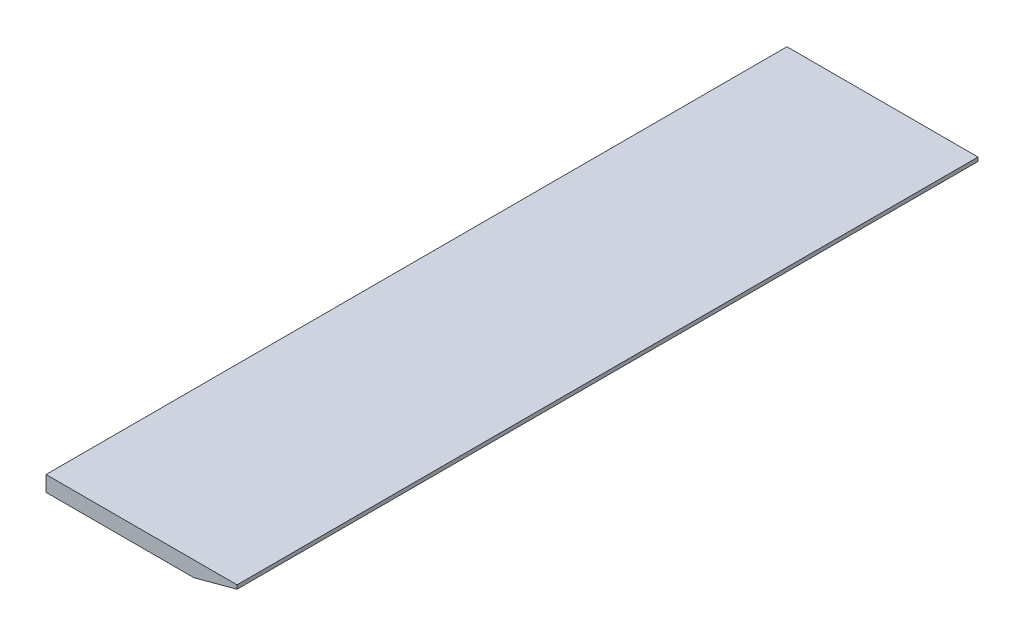
ISO-10303-21;
HEADER;
FILE_DESCRIPTION(('STEP AP214'),'2;1');
FILE_NAME('part.step','',(''),(''),'','','');
FILE_SCHEMA(('AUTOMOTIVE_DESIGN { 1 0 10303 214 1 1 1 1 }'));
ENDSEC;
DATA;
#1=APPLICATION_CONTEXT('core data for automotive mechanical design processes');
#2=APPLICATION_PROTOCOL_DEFINITION('international standard','automotive_design',2000,#1);
#3=PRODUCT_CONTEXT('',#1,'mechanical');
#4=PRODUCT('Part','Part','',(#3));
#5=PRODUCT_RELATED_PRODUCT_CATEGORY('part','',(#4));
#6=PRODUCT_DEFINITION_FORMATION('','',#4);
#7=PRODUCT_DEFINITION_CONTEXT('part definition',#1,'design');
#8=PRODUCT_DEFINITION('design','',#6,#7);
#9=PRODUCT_DEFINITION_SHAPE('','',#8);
#10=(LENGTH_UNIT() NAMED_UNIT(*) SI_UNIT(.MILLI.,.METRE.));
#11=(NAMED_UNIT(*) PLANE_ANGLE_UNIT() SI_UNIT($,.RADIAN.));
#12=(NAMED_UNIT(*) SI_UNIT($,.STERADIAN.) SOLID_ANGLE_UNIT());
#13=UNCERTAINTY_MEASURE_WITH_UNIT(LENGTH_MEASURE(1.E-05),#10,'distance_accuracy_value','');
#14=(GEOMETRIC_REPRESENTATION_CONTEXT(3) GLOBAL_UNCERTAINTY_ASSIGNED_CONTEXT((#13)) GLOBAL_UNIT_ASSIGNED_CONTEXT((#10,
#11,#12)) REPRESENTATION_CONTEXT('',''));
#15=CARTESIAN_POINT('',(0.,0.,0.));
#16=DIRECTION('',(0.,0.,1.));
#17=DIRECTION('',(1.,0.,0.));
#18=AXIS2_PLACEMENT_3D('',#15,#16,#17);
#19=CARTESIAN_POINT('',(121.627416057906,0.,304.8));
#20=DIRECTION('',(0.,1.,0.));
#21=DIRECTION('',(0.,0.,1.));
#22=AXIS2_PLACEMENT_3D('',#19,#20,#21);
#23=PLANE('',#22);
#24=DIRECTION('',(1.,0.,0.));
#25=VECTOR('',#24,1.);
#26=CARTESIAN_POINT('',(121.627416057906,0.,-304.8));
#27=LINE('',#26,#25);
#28=CARTESIAN_POINT('',(0.,0.,-304.8));
#29=VERTEX_POINT('',#28);
#30=CARTESIAN_POINT('',(121.627416057906,0.,-304.8));
#31=VERTEX_POINT('',#30);
#32=EDGE_CURVE('E106',#29,#31,#27,.T.);
#33=ORIENTED_EDGE('',*,*,#32,.T.);
#34=DIRECTION('',(0.,0.,-1.));
#35=VECTOR('',#34,1.);
#36=CARTESIAN_POINT('',(121.627416057906,0.,304.8));
#37=LINE('',#36,#35);
#38=CARTESIAN_POINT('',(121.627416057906,0.,304.8));
#39=VERTEX_POINT('',#38);
#40=EDGE_CURVE('E11',#39,#31,#37,.T.);
#41=ORIENTED_EDGE('',*,*,#40,.F.);
#42=DIRECTION('',(1.,0.,0.));
#43=VECTOR('',#42,1.);
#44=CARTESIAN_POINT('',(121.627416057906,0.,304.8));
#45=LINE('',#44,#43);
#46=CARTESIAN_POINT('',(0.,0.,304.8));
#47=VERTEX_POINT('',#46);
#48=EDGE_CURVE('E114',#47,#39,#45,.T.);
#49=ORIENTED_EDGE('',*,*,#48,.F.);
#50=DIRECTION('',(0.,0.,-1.));
#51=VECTOR('',#50,1.);
#52=CARTESIAN_POINT('',(0.,0.,304.8));
#53=LINE('',#52,#51);
#54=EDGE_CURVE('E102',#47,#29,#53,.T.);
#55=ORIENTED_EDGE('',*,*,#54,.T.);
#56=EDGE_LOOP('',(#33,#41,#49,#55));
#57=FACE_BOUND('',#56,.T.);
#58=ADVANCED_FACE('F32',(#57),#23,.F.);
#59=CARTESIAN_POINT('',(157.1752,9.52499999999998,304.8));
#60=DIRECTION('',(-0.258819045102515,0.96592582628907,0.));
#61=DIRECTION('',(-0.96592582628907,-0.258819045102515,0.));
#62=AXIS2_PLACEMENT_3D('',#59,#60,#61);
#63=PLANE('',#62);
#64=DIRECTION('',(0.96592582628907,0.258819045102515,0.));
#65=VECTOR('',#64,1.);
#66=CARTESIAN_POINT('',(157.1752,9.52499999999998,-304.8));
#67=LINE('',#66,#65);
#68=CARTESIAN_POINT('',(157.1752,9.52499999999998,-304.8));
#69=VERTEX_POINT('',#68);
#70=EDGE_CURVE('E109',#31,#69,#67,.T.);
#71=ORIENTED_EDGE('',*,*,#70,.T.);
#72=DIRECTION('',(0.,0.,-1.));
#73=VECTOR('',#72,1.);
#74=CARTESIAN_POINT('',(157.1752,9.52499999999998,304.8));
#75=LINE('',#74,#73);
#76=CARTESIAN_POINT('',(157.1752,9.52499999999998,304.8));
#77=VERTEX_POINT('',#76);
#78=EDGE_CURVE('E40',#77,#69,#75,.T.);
#79=ORIENTED_EDGE('',*,*,#78,.F.);
#80=DIRECTION('',(0.96592582628907,0.258819045102515,0.));
#81=VECTOR('',#80,1.);
#82=CARTESIAN_POINT('',(157.1752,9.52499999999998,304.8));
#83=LINE('',#82,#81);
#84=EDGE_CURVE('E82',#39,#77,#83,.T.);
#85=ORIENTED_EDGE('',*,*,#84,.F.);
#86=ORIENTED_EDGE('',*,*,#40,.T.);
#87=EDGE_LOOP('',(#71,#79,#85,#86));
#88=FACE_BOUND('',#87,.T.);
#89=ADVANCED_FACE('F133',(#88),#63,.F.);
#90=CARTESIAN_POINT('',(157.1752,12.7,304.8));
#91=DIRECTION('',(-1.,0.,0.));
#92=DIRECTION('',(0.,0.,1.));
#93=AXIS2_PLACEMENT_3D('',#90,#91,#92);
#94=PLANE('',#93);
#95=DIRECTION('',(0.,1.,0.));
#96=VECTOR('',#95,1.);
#97=CARTESIAN_POINT('',(157.1752,12.7,-304.8));
#98=LINE('',#97,#96);
#99=CARTESIAN_POINT('',(157.1752,12.7,-304.8));
#100=VERTEX_POINT('',#99);
#101=EDGE_CURVE('E97',#69,#100,#98,.T.);
#102=ORIENTED_EDGE('',*,*,#101,.T.);
#103=DIRECTION('',(0.,0.,-1.));
#104=VECTOR('',#103,1.);
#105=CARTESIAN_POINT('',(157.1752,12.7,304.8));
#106=LINE('',#105,#104);
#107=CARTESIAN_POINT('',(157.1752,12.7,304.8));
#108=VERTEX_POINT('',#107);
#109=EDGE_CURVE('E94',#108,#100,#106,.T.);
#110=ORIENTED_EDGE('',*,*,#109,.F.);
#111=DIRECTION('',(0.,1.,0.));
#112=VECTOR('',#111,1.);
#113=CARTESIAN_POINT('',(157.1752,12.7,304.8));
#114=LINE('',#113,#112);
#115=EDGE_CURVE('E86',#77,#108,#114,.T.);
#116=ORIENTED_EDGE('',*,*,#115,.F.);
#117=ORIENTED_EDGE('',*,*,#78,.T.);
#118=EDGE_LOOP('',(#102,#110,#116,#117));
#119=FACE_BOUND('',#118,.T.);
#120=ADVANCED_FACE('F95',(#119),#94,.F.);
#121=CARTESIAN_POINT('',(0.,12.7,304.8));
#122=DIRECTION('',(0.,-1.,0.));
#123=DIRECTION('',(0.,0.,-1.));
#124=AXIS2_PLACEMENT_3D('',#121,#122,#123);
#125=PLANE('',#124);
#126=DIRECTION('',(-1.,0.,0.));
#127=VECTOR('',#126,1.);
#128=CARTESIAN_POINT('',(0.,12.7,-304.8));
#129=LINE('',#128,#127);
#130=CARTESIAN_POINT('',(0.,12.7,-304.8));
#131=VERTEX_POINT('',#130);
#132=EDGE_CURVE('E68',#100,#131,#129,.T.);
#133=ORIENTED_EDGE('',*,*,#132,.T.);
#134=DIRECTION('',(0.,0.,-1.));
#135=VECTOR('',#134,1.);
#136=CARTESIAN_POINT('',(0.,12.7,304.8));
#137=LINE('',#136,#135);
#138=CARTESIAN_POINT('',(0.,12.7,304.8));
#139=VERTEX_POINT('',#138);
#140=EDGE_CURVE('E98',#139,#131,#137,.T.);
#141=ORIENTED_EDGE('',*,*,#140,.F.);
#142=DIRECTION('',(-1.,0.,0.));
#143=VECTOR('',#142,1.);
#144=CARTESIAN_POINT('',(0.,12.7,304.8));
#145=LINE('',#144,#143);
#146=EDGE_CURVE('E90',#108,#139,#145,.T.);
#147=ORIENTED_EDGE('',*,*,#146,.F.);
#148=ORIENTED_EDGE('',*,*,#109,.T.);
#149=EDGE_LOOP('',(#133,#141,#147,#148));
#150=FACE_BOUND('',#149,.T.);
#151=ADVANCED_FACE('F100',(#150),#125,.F.);
#152=CARTESIAN_POINT('',(0.,0.,304.8));
#153=DIRECTION('',(1.,0.,0.));
#154=DIRECTION('',(0.,0.,-1.));
#155=AXIS2_PLACEMENT_3D('',#152,#153,#154);
#156=PLANE('',#155);
#157=DIRECTION('',(0.,-1.,0.));
#158=VECTOR('',#157,1.);
#159=CARTESIAN_POINT('',(0.,0.,-304.8));
#160=LINE('',#159,#158);
#161=EDGE_CURVE('E74',#131,#29,#160,.T.);
#162=ORIENTED_EDGE('',*,*,#161,.T.);
#163=ORIENTED_EDGE('',*,*,#54,.F.);
#164=DIRECTION('',(0.,-1.,0.));
#165=VECTOR('',#164,1.);
#166=CARTESIAN_POINT('',(0.,0.,304.8));
#167=LINE('',#166,#165);
#168=EDGE_CURVE('E48',#139,#47,#167,.T.);
#169=ORIENTED_EDGE('',*,*,#168,.F.);
#170=ORIENTED_EDGE('',*,*,#140,.T.);
#171=EDGE_LOOP('',(#162,#163,#169,#170));
#172=FACE_BOUND('',#171,.T.);
#173=ADVANCED_FACE('F122',(#172),#156,.F.);
#174=CARTESIAN_POINT('',(0.,0.,304.8));
#175=DIRECTION('',(0.,0.,-1.));
#176=DIRECTION('',(-1.,0.,0.));
#177=AXIS2_PLACEMENT_3D('',#174,#175,#176);
#178=PLANE('',#177);
#179=ORIENTED_EDGE('',*,*,#48,.T.);
#180=ORIENTED_EDGE('',*,*,#84,.T.);
#181=ORIENTED_EDGE('',*,*,#115,.T.);
#182=ORIENTED_EDGE('',*,*,#146,.T.);
#183=ORIENTED_EDGE('',*,*,#168,.T.);
#184=EDGE_LOOP('',(#179,#180,#181,#182,#183));
#185=FACE_BOUND('',#184,.T.);
#186=ADVANCED_FACE('F88',(#185),#178,.F.);
#187=CARTESIAN_POINT('',(0.,0.,-304.8));
#188=DIRECTION('',(0.,0.,-1.));
#189=DIRECTION('',(-1.,0.,0.));
#190=AXIS2_PLACEMENT_3D('',#187,#188,#189);
#191=PLANE('',#190);
#192=ORIENTED_EDGE('',*,*,#32,.F.);
#193=ORIENTED_EDGE('',*,*,#161,.F.);
#194=ORIENTED_EDGE('',*,*,#132,.F.);
#195=ORIENTED_EDGE('',*,*,#101,.F.);
#196=ORIENTED_EDGE('',*,*,#70,.F.);
#197=EDGE_LOOP('',(#192,#193,#194,#195,#196));
#198=FACE_BOUND('',#197,.T.);
#199=ADVANCED_FACE('F118',(#198),#191,.T.);
#200=CLOSED_SHELL('',(#58,#89,#120,#151,#173,#186,#199));
#201=MANIFOLD_SOLID_BREP('B2',#200);
#202=ADVANCED_BREP_SHAPE_REPRESENTATION('',(#18,#201),#14);
#203=SHAPE_DEFINITION_REPRESENTATION(#9,#202);
ENDSEC;
END-ISO-10303-21;
